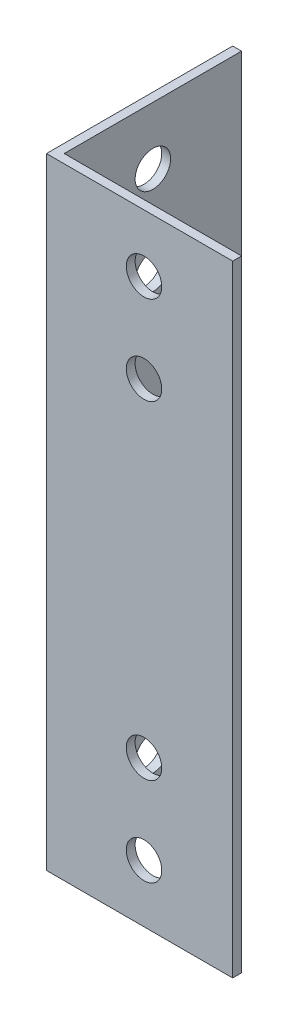
ISO-10303-21;
HEADER;
FILE_DESCRIPTION(('STEP AP214'),'2;1');
FILE_NAME('part.step','',(''),(''),'','','');
FILE_SCHEMA(('AUTOMOTIVE_DESIGN { 1 0 10303 214 1 1 1 1 }'));
ENDSEC;
DATA;
#1=APPLICATION_CONTEXT('core data for automotive mechanical design processes');
#2=APPLICATION_PROTOCOL_DEFINITION('international standard','automotive_design',2000,#1);
#3=PRODUCT_CONTEXT('',#1,'mechanical');
#4=PRODUCT('Part','Part','',(#3));
#5=PRODUCT_RELATED_PRODUCT_CATEGORY('part','',(#4));
#6=PRODUCT_DEFINITION_FORMATION('','',#4);
#7=PRODUCT_DEFINITION_CONTEXT('part definition',#1,'design');
#8=PRODUCT_DEFINITION('design','',#6,#7);
#9=PRODUCT_DEFINITION_SHAPE('','',#8);
#10=(LENGTH_UNIT() NAMED_UNIT(*) SI_UNIT(.MILLI.,.METRE.));
#11=(NAMED_UNIT(*) PLANE_ANGLE_UNIT() SI_UNIT($,.RADIAN.));
#12=(NAMED_UNIT(*) SI_UNIT($,.STERADIAN.) SOLID_ANGLE_UNIT());
#13=UNCERTAINTY_MEASURE_WITH_UNIT(LENGTH_MEASURE(1.E-05),#10,'distance_accuracy_value','');
#14=(GEOMETRIC_REPRESENTATION_CONTEXT(3) GLOBAL_UNCERTAINTY_ASSIGNED_CONTEXT((#13)) GLOBAL_UNIT_ASSIGNED_CONTEXT((#10,
#11,#12)) REPRESENTATION_CONTEXT('',''));
#15=CARTESIAN_POINT('',(0.,0.,0.));
#16=DIRECTION('',(0.,0.,1.));
#17=DIRECTION('',(1.,0.,0.));
#18=AXIS2_PLACEMENT_3D('',#15,#16,#17);
#19=CARTESIAN_POINT('',(21.,70.,0.));
#20=DIRECTION('',(0.,0.,-1.));
#21=DIRECTION('',(-1.,0.,0.));
#22=AXIS2_PLACEMENT_3D('',#19,#20,#21);
#23=PLANE('',#22);
#24=CARTESIAN_POINT('',(11.,16.5,0.));
#25=DIRECTION('',(0.,0.,-1.));
#26=DIRECTION('',(-1.,0.,0.));
#27=AXIS2_PLACEMENT_3D('',#24,#25,#26);
#28=CIRCLE('',#27,2.);
#29=CARTESIAN_POINT('',(9.00000000000001,16.5,0.));
#30=VERTEX_POINT('',#29);
#31=EDGE_CURVE('E161',#30,#30,#28,.F.);
#32=ORIENTED_EDGE('',*,*,#31,.F.);
#33=EDGE_LOOP('',(#32));
#34=FACE_BOUND('',#33,.T.);
#35=CARTESIAN_POINT('',(11.,6.50000000000001,0.));
#36=DIRECTION('',(0.,0.,-1.));
#37=DIRECTION('',(-1.,0.,0.));
#38=AXIS2_PLACEMENT_3D('',#35,#36,#37);
#39=CIRCLE('',#38,2.);
#40=CARTESIAN_POINT('',(9.00000000000001,6.50000000000001,0.));
#41=VERTEX_POINT('',#40);
#42=EDGE_CURVE('E165',#41,#41,#39,.F.);
#43=ORIENTED_EDGE('',*,*,#42,.F.);
#44=EDGE_LOOP('',(#43));
#45=FACE_BOUND('',#44,.T.);
#46=CARTESIAN_POINT('',(11.,63.5,0.));
#47=DIRECTION('',(0.,0.,-1.));
#48=DIRECTION('',(-1.,0.,0.));
#49=AXIS2_PLACEMENT_3D('',#46,#47,#48);
#50=CIRCLE('',#49,2.);
#51=CARTESIAN_POINT('',(9.00000000000001,63.5,0.));
#52=VERTEX_POINT('',#51);
#53=EDGE_CURVE('E169',#52,#52,#50,.F.);
#54=ORIENTED_EDGE('',*,*,#53,.F.);
#55=EDGE_LOOP('',(#54));
#56=FACE_BOUND('',#55,.T.);
#57=CARTESIAN_POINT('',(11.,53.5,0.));
#58=DIRECTION('',(0.,0.,-1.));
#59=DIRECTION('',(-1.,0.,0.));
#60=AXIS2_PLACEMENT_3D('',#57,#58,#59);
#61=CIRCLE('',#60,2.);
#62=CARTESIAN_POINT('',(9.00000000000001,53.5,0.));
#63=VERTEX_POINT('',#62);
#64=EDGE_CURVE('E172',#63,#63,#61,.F.);
#65=ORIENTED_EDGE('',*,*,#64,.F.);
#66=EDGE_LOOP('',(#65));
#67=FACE_BOUND('',#66,.T.);
#68=DIRECTION('',(1.,0.,0.));
#69=VECTOR('',#68,1.);
#70=CARTESIAN_POINT('',(21.,0.,0.));
#71=LINE('',#70,#69);
#72=CARTESIAN_POINT('',(0.,0.,0.));
#73=VERTEX_POINT('',#72);
#74=CARTESIAN_POINT('',(21.,0.,0.));
#75=VERTEX_POINT('',#74);
#76=EDGE_CURVE('E115',#73,#75,#71,.T.);
#77=ORIENTED_EDGE('',*,*,#76,.T.);
#78=DIRECTION('',(0.,-1.,0.));
#79=VECTOR('',#78,1.);
#80=CARTESIAN_POINT('',(21.,70.,0.));
#81=LINE('',#80,#79);
#82=CARTESIAN_POINT('',(21.,70.,0.));
#83=VERTEX_POINT('',#82);
#84=EDGE_CURVE('E11',#83,#75,#81,.T.);
#85=ORIENTED_EDGE('',*,*,#84,.F.);
#86=DIRECTION('',(1.,0.,0.));
#87=VECTOR('',#86,1.);
#88=CARTESIAN_POINT('',(21.,70.,0.));
#89=LINE('',#88,#87);
#90=CARTESIAN_POINT('',(0.,70.,0.));
#91=VERTEX_POINT('',#90);
#92=EDGE_CURVE('E126',#91,#83,#89,.T.);
#93=ORIENTED_EDGE('',*,*,#92,.F.);
#94=DIRECTION('',(0.,-1.,0.));
#95=VECTOR('',#94,1.);
#96=CARTESIAN_POINT('',(0.,70.,0.));
#97=LINE('',#96,#95);
#98=EDGE_CURVE('E111',#91,#73,#97,.T.);
#99=ORIENTED_EDGE('',*,*,#98,.T.);
#100=EDGE_LOOP('',(#77,#85,#93,#99));
#101=FACE_BOUND('',#100,.T.);
#102=ADVANCED_FACE('F31',(#34,#45,#56,#67,#101),#23,.F.);
#103=CARTESIAN_POINT('',(21.,70.,-1.00000000000009));
#104=DIRECTION('',(-1.,0.,0.));
#105=DIRECTION('',(0.,0.,1.));
#106=AXIS2_PLACEMENT_3D('',#103,#104,#105);
#107=PLANE('',#106);
#108=DIRECTION('',(0.,0.,-1.));
#109=VECTOR('',#108,1.);
#110=CARTESIAN_POINT('',(21.,0.,-1.00000000000009));
#111=LINE('',#110,#109);
#112=CARTESIAN_POINT('',(21.,0.,-1.00000000000009));
#113=VERTEX_POINT('',#112);
#114=EDGE_CURVE('E118',#75,#113,#111,.T.);
#115=ORIENTED_EDGE('',*,*,#114,.T.);
#116=DIRECTION('',(0.,-1.,0.));
#117=VECTOR('',#116,1.);
#118=CARTESIAN_POINT('',(21.,70.,-1.00000000000009));
#119=LINE('',#118,#117);
#120=CARTESIAN_POINT('',(21.,70.,-1.00000000000009));
#121=VERTEX_POINT('',#120);
#122=EDGE_CURVE('E39',#121,#113,#119,.T.);
#123=ORIENTED_EDGE('',*,*,#122,.F.);
#124=DIRECTION('',(0.,0.,-1.));
#125=VECTOR('',#124,1.);
#126=CARTESIAN_POINT('',(21.,70.,-1.00000000000009));
#127=LINE('',#126,#125);
#128=EDGE_CURVE('E84',#83,#121,#127,.T.);
#129=ORIENTED_EDGE('',*,*,#128,.F.);
#130=ORIENTED_EDGE('',*,*,#84,.T.);
#131=EDGE_LOOP('',(#115,#123,#129,#130));
#132=FACE_BOUND('',#131,.T.);
#133=ADVANCED_FACE('F153',(#132),#107,.F.);
#134=CARTESIAN_POINT('',(1.,70.,-1.));
#135=DIRECTION('',(0.,0.,1.));
#136=DIRECTION('',(1.,0.,0.));
#137=AXIS2_PLACEMENT_3D('',#134,#135,#136);
#138=PLANE('',#137);
#139=CARTESIAN_POINT('',(11.,16.5,-1.00000000000004));
#140=DIRECTION('',(0.,0.,-1.));
#141=DIRECTION('',(1.,0.,0.));
#142=AXIS2_PLACEMENT_3D('',#139,#140,#141);
#143=CIRCLE('',#142,2.);
#144=CARTESIAN_POINT('',(13.,16.5,-1.00000000000005));
#145=VERTEX_POINT('',#144);
#146=EDGE_CURVE('E247',#145,#145,#143,.T.);
#147=ORIENTED_EDGE('',*,*,#146,.F.);
#148=EDGE_LOOP('',(#147));
#149=FACE_BOUND('',#148,.T.);
#150=CARTESIAN_POINT('',(11.,6.50000000000001,-1.00000000000004));
#151=DIRECTION('',(0.,0.,-1.));
#152=DIRECTION('',(1.,0.,0.));
#153=AXIS2_PLACEMENT_3D('',#150,#151,#152);
#154=CIRCLE('',#153,2.);
#155=CARTESIAN_POINT('',(13.,6.50000000000001,-1.00000000000005));
#156=VERTEX_POINT('',#155);
#157=EDGE_CURVE('E248',#156,#156,#154,.T.);
#158=ORIENTED_EDGE('',*,*,#157,.F.);
#159=EDGE_LOOP('',(#158));
#160=FACE_BOUND('',#159,.T.);
#161=CARTESIAN_POINT('',(11.,63.5,-1.00000000000004));
#162=DIRECTION('',(0.,0.,-1.));
#163=DIRECTION('',(-1.,0.,0.));
#164=AXIS2_PLACEMENT_3D('',#161,#162,#163);
#165=CIRCLE('',#164,2.);
#166=CARTESIAN_POINT('',(9.00000000000001,63.5,-1.00000000000004));
#167=VERTEX_POINT('',#166);
#168=EDGE_CURVE('E255',#167,#167,#165,.T.);
#169=ORIENTED_EDGE('',*,*,#168,.F.);
#170=EDGE_LOOP('',(#169));
#171=FACE_BOUND('',#170,.T.);
#172=CARTESIAN_POINT('',(11.,53.5,-1.00000000000004));
#173=DIRECTION('',(0.,0.,-1.));
#174=DIRECTION('',(-1.,0.,0.));
#175=AXIS2_PLACEMENT_3D('',#172,#173,#174);
#176=CIRCLE('',#175,2.);
#177=CARTESIAN_POINT('',(9.00000000000001,53.5,-1.00000000000004));
#178=VERTEX_POINT('',#177);
#179=EDGE_CURVE('E175',#178,#178,#176,.T.);
#180=ORIENTED_EDGE('',*,*,#179,.F.);
#181=EDGE_LOOP('',(#180));
#182=FACE_BOUND('',#181,.T.);
#183=DIRECTION('',(-1.,0.,0.));
#184=VECTOR('',#183,1.);
#185=CARTESIAN_POINT('',(1.,0.,-1.));
#186=LINE('',#185,#184);
#187=CARTESIAN_POINT('',(1.,0.,-1.));
#188=VERTEX_POINT('',#187);
#189=EDGE_CURVE('E121',#113,#188,#186,.T.);
#190=ORIENTED_EDGE('',*,*,#189,.T.);
#191=DIRECTION('',(0.,-1.,0.));
#192=VECTOR('',#191,1.);
#193=CARTESIAN_POINT('',(1.,70.,-1.));
#194=LINE('',#193,#192);
#195=CARTESIAN_POINT('',(1.,70.,-1.));
#196=VERTEX_POINT('',#195);
#197=EDGE_CURVE('E106',#196,#188,#194,.T.);
#198=ORIENTED_EDGE('',*,*,#197,.F.);
#199=DIRECTION('',(-1.,0.,0.));
#200=VECTOR('',#199,1.);
#201=CARTESIAN_POINT('',(1.,70.,-1.));
#202=LINE('',#201,#200);
#203=EDGE_CURVE('E97',#121,#196,#202,.T.);
#204=ORIENTED_EDGE('',*,*,#203,.F.);
#205=ORIENTED_EDGE('',*,*,#122,.T.);
#206=EDGE_LOOP('',(#190,#198,#204,#205));
#207=FACE_BOUND('',#206,.T.);
#208=ADVANCED_FACE('F132',(#149,#160,#171,#182,#207),#138,.F.);
#209=CARTESIAN_POINT('',(1.,70.,-21.));
#210=DIRECTION('',(-1.,0.,0.));
#211=DIRECTION('',(0.,0.,1.));
#212=AXIS2_PLACEMENT_3D('',#209,#210,#211);
#213=PLANE('',#212);
#214=CARTESIAN_POINT('',(1.,63.5,-11.));
#215=DIRECTION('',(1.,0.,0.));
#216=DIRECTION('',(0.,0.,1.));
#217=AXIS2_PLACEMENT_3D('',#214,#215,#216);
#218=CIRCLE('',#217,2.);
#219=CARTESIAN_POINT('',(1.,63.5,-9.00000000000001));
#220=VERTEX_POINT('',#219);
#221=EDGE_CURVE('E174',#220,#220,#218,.T.);
#222=ORIENTED_EDGE('',*,*,#221,.F.);
#223=EDGE_LOOP('',(#222));
#224=FACE_BOUND('',#223,.T.);
#225=CARTESIAN_POINT('',(1.,53.5,-11.));
#226=DIRECTION('',(1.,0.,0.));
#227=DIRECTION('',(0.,0.,1.));
#228=AXIS2_PLACEMENT_3D('',#225,#226,#227);
#229=CIRCLE('',#228,2.);
#230=CARTESIAN_POINT('',(1.,53.5,-9.00000000000001));
#231=VERTEX_POINT('',#230);
#232=EDGE_CURVE('E186',#231,#231,#229,.T.);
#233=ORIENTED_EDGE('',*,*,#232,.F.);
#234=EDGE_LOOP('',(#233));
#235=FACE_BOUND('',#234,.T.);
#236=CARTESIAN_POINT('',(1.,6.5,-11.));
#237=DIRECTION('',(1.,0.,0.));
#238=DIRECTION('',(0.,0.,-1.));
#239=AXIS2_PLACEMENT_3D('',#236,#237,#238);
#240=CIRCLE('',#239,2.);
#241=CARTESIAN_POINT('',(1.,6.5,-13.));
#242=VERTEX_POINT('',#241);
#243=EDGE_CURVE('E192',#242,#242,#240,.T.);
#244=ORIENTED_EDGE('',*,*,#243,.F.);
#245=EDGE_LOOP('',(#244));
#246=FACE_BOUND('',#245,.T.);
#247=CARTESIAN_POINT('',(1.,16.5,-11.));
#248=DIRECTION('',(1.,0.,0.));
#249=DIRECTION('',(0.,0.,-1.));
#250=AXIS2_PLACEMENT_3D('',#247,#248,#249);
#251=CIRCLE('',#250,2.);
#252=CARTESIAN_POINT('',(1.,16.5,-13.));
#253=VERTEX_POINT('',#252);
#254=EDGE_CURVE('E198',#253,#253,#251,.T.);
#255=ORIENTED_EDGE('',*,*,#254,.F.);
#256=EDGE_LOOP('',(#255));
#257=FACE_BOUND('',#256,.T.);
#258=DIRECTION('',(0.,0.,-1.));
#259=VECTOR('',#258,1.);
#260=CARTESIAN_POINT('',(1.,0.,-21.));
#261=LINE('',#260,#259);
#262=CARTESIAN_POINT('',(1.,0.,-21.));
#263=VERTEX_POINT('',#262);
#264=EDGE_CURVE('E105',#188,#263,#261,.T.);
#265=ORIENTED_EDGE('',*,*,#264,.T.);
#266=DIRECTION('',(0.,-1.,0.));
#267=VECTOR('',#266,1.);
#268=CARTESIAN_POINT('',(1.,70.,-21.));
#269=LINE('',#268,#267);
#270=CARTESIAN_POINT('',(1.,70.,-21.));
#271=VERTEX_POINT('',#270);
#272=EDGE_CURVE('E102',#271,#263,#269,.T.);
#273=ORIENTED_EDGE('',*,*,#272,.F.);
#274=DIRECTION('',(0.,0.,-1.));
#275=VECTOR('',#274,1.);
#276=CARTESIAN_POINT('',(1.,70.,-21.));
#277=LINE('',#276,#275);
#278=EDGE_CURVE('E91',#196,#271,#277,.T.);
#279=ORIENTED_EDGE('',*,*,#278,.F.);
#280=ORIENTED_EDGE('',*,*,#197,.T.);
#281=EDGE_LOOP('',(#265,#273,#279,#280));
#282=FACE_BOUND('',#281,.T.);
#283=ADVANCED_FACE('F103',(#224,#235,#246,#257,#282),#213,.F.);
#284=CARTESIAN_POINT('',(0.,70.,-21.));
#285=DIRECTION('',(0.,0.,1.));
#286=DIRECTION('',(1.,0.,0.));
#287=AXIS2_PLACEMENT_3D('',#284,#285,#286);
#288=PLANE('',#287);
#289=DIRECTION('',(-1.,0.,0.));
#290=VECTOR('',#289,1.);
#291=CARTESIAN_POINT('',(0.,0.,-21.));
#292=LINE('',#291,#290);
#293=CARTESIAN_POINT('',(0.,0.,-21.));
#294=VERTEX_POINT('',#293);
#295=EDGE_CURVE('E70',#263,#294,#292,.T.);
#296=ORIENTED_EDGE('',*,*,#295,.T.);
#297=DIRECTION('',(0.,-1.,0.));
#298=VECTOR('',#297,1.);
#299=CARTESIAN_POINT('',(0.,70.,-21.));
#300=LINE('',#299,#298);
#301=CARTESIAN_POINT('',(0.,70.,-21.));
#302=VERTEX_POINT('',#301);
#303=EDGE_CURVE('E107',#302,#294,#300,.T.);
#304=ORIENTED_EDGE('',*,*,#303,.F.);
#305=DIRECTION('',(-1.,0.,0.));
#306=VECTOR('',#305,1.);
#307=CARTESIAN_POINT('',(0.,70.,-21.));
#308=LINE('',#307,#306);
#309=EDGE_CURVE('E95',#271,#302,#308,.T.);
#310=ORIENTED_EDGE('',*,*,#309,.F.);
#311=ORIENTED_EDGE('',*,*,#272,.T.);
#312=EDGE_LOOP('',(#296,#304,#310,#311));
#313=FACE_BOUND('',#312,.T.);
#314=ADVANCED_FACE('F109',(#313),#288,.F.);
#315=CARTESIAN_POINT('',(0.,70.,0.));
#316=DIRECTION('',(1.,0.,0.));
#317=DIRECTION('',(0.,0.,-1.));
#318=AXIS2_PLACEMENT_3D('',#315,#316,#317);
#319=PLANE('',#318);
#320=CARTESIAN_POINT('',(0.,63.5,-11.));
#321=DIRECTION('',(1.,0.,0.));
#322=DIRECTION('',(0.,0.,-1.));
#323=AXIS2_PLACEMENT_3D('',#320,#321,#322);
#324=CIRCLE('',#323,2.);
#325=CARTESIAN_POINT('',(0.,63.5,-13.));
#326=VERTEX_POINT('',#325);
#327=EDGE_CURVE('E178',#326,#326,#324,.F.);
#328=ORIENTED_EDGE('',*,*,#327,.F.);
#329=EDGE_LOOP('',(#328));
#330=FACE_BOUND('',#329,.T.);
#331=CARTESIAN_POINT('',(0.,53.5,-11.));
#332=DIRECTION('',(1.,0.,0.));
#333=DIRECTION('',(0.,0.,-1.));
#334=AXIS2_PLACEMENT_3D('',#331,#332,#333);
#335=CIRCLE('',#334,2.);
#336=CARTESIAN_POINT('',(0.,53.5,-13.));
#337=VERTEX_POINT('',#336);
#338=EDGE_CURVE('E189',#337,#337,#335,.F.);
#339=ORIENTED_EDGE('',*,*,#338,.F.);
#340=EDGE_LOOP('',(#339));
#341=FACE_BOUND('',#340,.T.);
#342=CARTESIAN_POINT('',(0.,6.5,-11.));
#343=DIRECTION('',(1.,0.,0.));
#344=DIRECTION('',(0.,0.,-1.));
#345=AXIS2_PLACEMENT_3D('',#342,#343,#344);
#346=CIRCLE('',#345,2.);
#347=CARTESIAN_POINT('',(0.,6.5,-13.));
#348=VERTEX_POINT('',#347);
#349=EDGE_CURVE('E195',#348,#348,#346,.F.);
#350=ORIENTED_EDGE('',*,*,#349,.F.);
#351=EDGE_LOOP('',(#350));
#352=FACE_BOUND('',#351,.T.);
#353=CARTESIAN_POINT('',(0.,16.5,-11.));
#354=DIRECTION('',(1.,0.,0.));
#355=DIRECTION('',(0.,0.,-1.));
#356=AXIS2_PLACEMENT_3D('',#353,#354,#355);
#357=CIRCLE('',#356,2.);
#358=CARTESIAN_POINT('',(0.,16.5,-13.));
#359=VERTEX_POINT('',#358);
#360=EDGE_CURVE('E119',#359,#359,#357,.F.);
#361=ORIENTED_EDGE('',*,*,#360,.F.);
#362=EDGE_LOOP('',(#361));
#363=FACE_BOUND('',#362,.T.);
#364=DIRECTION('',(0.,0.,1.));
#365=VECTOR('',#364,1.);
#366=CARTESIAN_POINT('',(0.,0.,0.));
#367=LINE('',#366,#365);
#368=EDGE_CURVE('E76',#294,#73,#367,.T.);
#369=ORIENTED_EDGE('',*,*,#368,.T.);
#370=ORIENTED_EDGE('',*,*,#98,.F.);
#371=DIRECTION('',(0.,0.,1.));
#372=VECTOR('',#371,1.);
#373=CARTESIAN_POINT('',(0.,70.,0.));
#374=LINE('',#373,#372);
#375=EDGE_CURVE('E47',#302,#91,#374,.T.);
#376=ORIENTED_EDGE('',*,*,#375,.F.);
#377=ORIENTED_EDGE('',*,*,#303,.T.);
#378=EDGE_LOOP('',(#369,#370,#376,#377));
#379=FACE_BOUND('',#378,.T.);
#380=ADVANCED_FACE('F139',(#330,#341,#352,#363,#379),#319,.F.);
#381=CARTESIAN_POINT('',(0.,70.,0.));
#382=DIRECTION('',(0.,-1.,0.));
#383=DIRECTION('',(0.,0.,-1.));
#384=AXIS2_PLACEMENT_3D('',#381,#382,#383);
#385=PLANE('',#384);
#386=ORIENTED_EDGE('',*,*,#92,.T.);
#387=ORIENTED_EDGE('',*,*,#128,.T.);
#388=ORIENTED_EDGE('',*,*,#203,.T.);
#389=ORIENTED_EDGE('',*,*,#278,.T.);
#390=ORIENTED_EDGE('',*,*,#309,.T.);
#391=ORIENTED_EDGE('',*,*,#375,.T.);
#392=EDGE_LOOP('',(#386,#387,#388,#389,#390,#391));
#393=FACE_BOUND('',#392,.T.);
#394=ADVANCED_FACE('F93',(#393),#385,.F.);
#395=CARTESIAN_POINT('',(0.,0.,0.));
#396=DIRECTION('',(0.,-1.,0.));
#397=DIRECTION('',(0.,0.,-1.));
#398=AXIS2_PLACEMENT_3D('',#395,#396,#397);
#399=PLANE('',#398);
#400=ORIENTED_EDGE('',*,*,#76,.F.);
#401=ORIENTED_EDGE('',*,*,#368,.F.);
#402=ORIENTED_EDGE('',*,*,#295,.F.);
#403=ORIENTED_EDGE('',*,*,#264,.F.);
#404=ORIENTED_EDGE('',*,*,#189,.F.);
#405=ORIENTED_EDGE('',*,*,#114,.F.);
#406=EDGE_LOOP('',(#400,#401,#402,#403,#404,#405));
#407=FACE_BOUND('',#406,.T.);
#408=ADVANCED_FACE('F135',(#407),#399,.T.);
#409=CARTESIAN_POINT('',(-0.00100000000000122,16.5,-11.));
#410=DIRECTION('',(1.,0.,0.));
#411=DIRECTION('',(0.,0.,-1.));
#412=AXIS2_PLACEMENT_3D('',#409,#410,#411);
#413=CYLINDRICAL_SURFACE('',#412,2.);
#414=ORIENTED_EDGE('',*,*,#254,.T.);
#415=EDGE_LOOP('',(#414));
#416=FACE_BOUND('',#415,.T.);
#417=ORIENTED_EDGE('',*,*,#360,.T.);
#418=EDGE_LOOP('',(#417));
#419=FACE_BOUND('',#418,.T.);
#420=ADVANCED_FACE('F206',(#416,#419),#413,.F.);
#421=CARTESIAN_POINT('',(-0.00100000000000122,6.5,-11.));
#422=DIRECTION('',(1.,0.,0.));
#423=DIRECTION('',(0.,0.,-1.));
#424=AXIS2_PLACEMENT_3D('',#421,#422,#423);
#425=CYLINDRICAL_SURFACE('',#424,2.);
#426=ORIENTED_EDGE('',*,*,#243,.T.);
#427=EDGE_LOOP('',(#426));
#428=FACE_BOUND('',#427,.T.);
#429=ORIENTED_EDGE('',*,*,#349,.T.);
#430=EDGE_LOOP('',(#429));
#431=FACE_BOUND('',#430,.T.);
#432=ADVANCED_FACE('F209',(#428,#431),#425,.F.);
#433=CARTESIAN_POINT('',(-0.00100000000000122,53.5,-11.));
#434=DIRECTION('',(1.,0.,0.));
#435=DIRECTION('',(0.,0.,-1.));
#436=AXIS2_PLACEMENT_3D('',#433,#434,#435);
#437=CYLINDRICAL_SURFACE('',#436,2.);
#438=ORIENTED_EDGE('',*,*,#232,.T.);
#439=EDGE_LOOP('',(#438));
#440=FACE_BOUND('',#439,.T.);
#441=ORIENTED_EDGE('',*,*,#338,.T.);
#442=EDGE_LOOP('',(#441));
#443=FACE_BOUND('',#442,.T.);
#444=ADVANCED_FACE('F216',(#440,#443),#437,.F.);
#445=CARTESIAN_POINT('',(-0.00100000000000122,63.5,-11.));
#446=DIRECTION('',(1.,0.,0.));
#447=DIRECTION('',(0.,0.,-1.));
#448=AXIS2_PLACEMENT_3D('',#445,#446,#447);
#449=CYLINDRICAL_SURFACE('',#448,2.);
#450=ORIENTED_EDGE('',*,*,#221,.T.);
#451=EDGE_LOOP('',(#450));
#452=FACE_BOUND('',#451,.T.);
#453=ORIENTED_EDGE('',*,*,#327,.T.);
#454=EDGE_LOOP('',(#453));
#455=FACE_BOUND('',#454,.T.);
#456=ADVANCED_FACE('F222',(#452,#455),#449,.F.);
#457=CARTESIAN_POINT('',(11.,53.5,0.00100000000004047));
#458=DIRECTION('',(0.,0.,-1.));
#459=DIRECTION('',(-1.,0.,0.));
#460=AXIS2_PLACEMENT_3D('',#457,#458,#459);
#461=CYLINDRICAL_SURFACE('',#460,2.);
#462=ORIENTED_EDGE('',*,*,#179,.T.);
#463=EDGE_LOOP('',(#462));
#464=FACE_BOUND('',#463,.T.);
#465=ORIENTED_EDGE('',*,*,#64,.T.);
#466=EDGE_LOOP('',(#465));
#467=FACE_BOUND('',#466,.T.);
#468=ADVANCED_FACE('F226',(#464,#467),#461,.F.);
#469=CARTESIAN_POINT('',(11.,63.5,0.00100000000004047));
#470=DIRECTION('',(0.,0.,-1.));
#471=DIRECTION('',(-1.,0.,0.));
#472=AXIS2_PLACEMENT_3D('',#469,#470,#471);
#473=CYLINDRICAL_SURFACE('',#472,2.);
#474=ORIENTED_EDGE('',*,*,#168,.T.);
#475=EDGE_LOOP('',(#474));
#476=FACE_BOUND('',#475,.T.);
#477=ORIENTED_EDGE('',*,*,#53,.T.);
#478=EDGE_LOOP('',(#477));
#479=FACE_BOUND('',#478,.T.);
#480=ADVANCED_FACE('F230',(#476,#479),#473,.F.);
#481=CARTESIAN_POINT('',(11.,6.50000000000001,0.00100000000004047));
#482=DIRECTION('',(0.,0.,-1.));
#483=DIRECTION('',(-1.,0.,0.));
#484=AXIS2_PLACEMENT_3D('',#481,#482,#483);
#485=CYLINDRICAL_SURFACE('',#484,2.);
#486=ORIENTED_EDGE('',*,*,#157,.T.);
#487=EDGE_LOOP('',(#486));
#488=FACE_BOUND('',#487,.T.);
#489=ORIENTED_EDGE('',*,*,#42,.T.);
#490=EDGE_LOOP('',(#489));
#491=FACE_BOUND('',#490,.T.);
#492=ADVANCED_FACE('F234',(#488,#491),#485,.F.);
#493=CARTESIAN_POINT('',(11.,16.5,0.00100000000004047));
#494=DIRECTION('',(0.,0.,-1.));
#495=DIRECTION('',(-1.,0.,0.));
#496=AXIS2_PLACEMENT_3D('',#493,#494,#495);
#497=CYLINDRICAL_SURFACE('',#496,2.);
#498=ORIENTED_EDGE('',*,*,#146,.T.);
#499=EDGE_LOOP('',(#498));
#500=FACE_BOUND('',#499,.T.);
#501=ORIENTED_EDGE('',*,*,#31,.T.);
#502=EDGE_LOOP('',(#501));
#503=FACE_BOUND('',#502,.T.);
#504=ADVANCED_FACE('F238',(#500,#503),#497,.F.);
#505=CLOSED_SHELL('',(#102,#133,#208,#283,#314,#380,#394,#408,#420,#432,#444,#456,#468,#480,
#492,#504));
#506=MANIFOLD_SOLID_BREP('B2',#505);
#507=ADVANCED_BREP_SHAPE_REPRESENTATION('',(#18,#506),#14);
#508=SHAPE_DEFINITION_REPRESENTATION(#9,#507);
ENDSEC;
END-ISO-10303-21;
